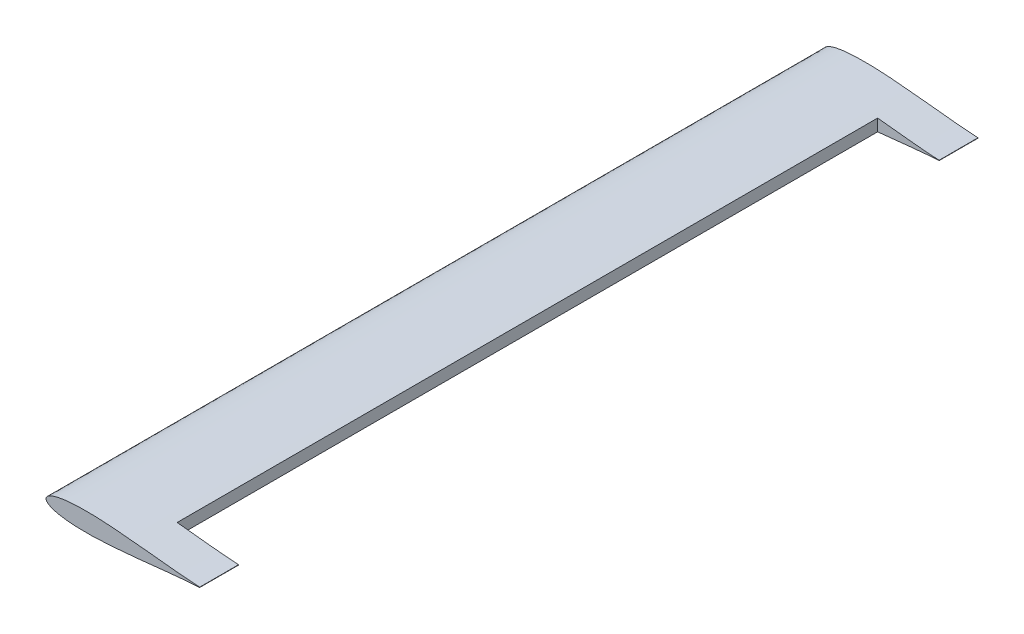
ISO-10303-21;
HEADER;
FILE_DESCRIPTION(('STEP AP214'),'2;1');
FILE_NAME('part.step','',(''),(''),'','','');
FILE_SCHEMA(('AUTOMOTIVE_DESIGN { 1 0 10303 214 1 1 1 1 }'));
ENDSEC;
DATA;
#1=APPLICATION_CONTEXT('core data for automotive mechanical design processes');
#2=APPLICATION_PROTOCOL_DEFINITION('international standard','automotive_design',2000,#1);
#3=PRODUCT_CONTEXT('',#1,'mechanical');
#4=PRODUCT('Part','Part','',(#3));
#5=PRODUCT_RELATED_PRODUCT_CATEGORY('part','',(#4));
#6=PRODUCT_DEFINITION_FORMATION('','',#4);
#7=PRODUCT_DEFINITION_CONTEXT('part definition',#1,'design');
#8=PRODUCT_DEFINITION('design','',#6,#7);
#9=PRODUCT_DEFINITION_SHAPE('','',#8);
#10=(LENGTH_UNIT() NAMED_UNIT(*) SI_UNIT(.MILLI.,.METRE.));
#11=(NAMED_UNIT(*) PLANE_ANGLE_UNIT() SI_UNIT($,.RADIAN.));
#12=(NAMED_UNIT(*) SI_UNIT($,.STERADIAN.) SOLID_ANGLE_UNIT());
#13=UNCERTAINTY_MEASURE_WITH_UNIT(LENGTH_MEASURE(1.E-05),#10,'distance_accuracy_value','');
#14=(GEOMETRIC_REPRESENTATION_CONTEXT(3) GLOBAL_UNCERTAINTY_ASSIGNED_CONTEXT((#13)) GLOBAL_UNIT_ASSIGNED_CONTEXT((#10,
#11,#12)) REPRESENTATION_CONTEXT('',''));
#15=CARTESIAN_POINT('',(0.,0.,0.));
#16=DIRECTION('',(0.,0.,1.));
#17=DIRECTION('',(1.,0.,0.));
#18=AXIS2_PLACEMENT_3D('',#15,#16,#17);
#19=CARTESIAN_POINT('',(120.380960042621,0.131910968299272,609.6));
#20=CARTESIAN_POINT('',(119.946341591372,0.152711181717035,609.6));
#21=CARTESIAN_POINT('',(118.879825677907,0.207805592630858,609.6));
#22=CARTESIAN_POINT('',(117.08577875424,0.313677955019402,609.6));
#23=CARTESIAN_POINT('',(114.917831353132,0.458373702508884,609.6));
#24=CARTESIAN_POINT('',(112.492651454339,0.638201877057179,609.6));
#25=CARTESIAN_POINT('',(109.822798752675,0.853719310043422,609.6));
#26=CARTESIAN_POINT('',(106.921074515127,1.10596019781908,609.6));
#27=CARTESIAN_POINT('',(103.801681224574,1.39396086564061,609.6));
#28=CARTESIAN_POINT('',(100.479715379678,1.715903258336,609.6));
#29=CARTESIAN_POINT('',(96.9715098852466,2.06983989009972,609.6));
#30=CARTESIAN_POINT('',(93.2940190845133,2.45178338883161,609.6));
#31=CARTESIAN_POINT('',(89.4652669803332,2.85749965001338,609.6));
#32=CARTESIAN_POINT('',(85.5038265683255,3.28175383962361,609.6));
#33=CARTESIAN_POINT('',(81.4290640584128,3.71867043285444,609.6));
#34=CARTESIAN_POINT('',(77.2607857308432,4.16196644332822,609.6));
#35=CARTESIAN_POINT('',(73.0192540187374,4.60412633833737,609.6));
#36=CARTESIAN_POINT('',(68.7251814615755,5.03833014971487,609.6));
#37=CARTESIAN_POINT('',(64.3993954621691,5.45636241090781,609.6));
#38=CARTESIAN_POINT('',(60.0630689422249,5.8511871806983,609.6));
#39=CARTESIAN_POINT('',(55.7371976249328,6.21450453810976,609.6));
#40=CARTESIAN_POINT('',(51.4429170425396,6.53920292922603,609.6));
#41=CARTESIAN_POINT('',(47.2010682216459,6.81814245926459,609.6));
#42=CARTESIAN_POINT('',(43.032378562393,7.044765482812,609.6));
#43=CARTESIAN_POINT('',(38.9570756240423,7.2131238750651,609.6));
#44=CARTESIAN_POINT('',(34.9950535304907,7.31806129272744,609.6));
#45=CARTESIAN_POINT('',(31.1655369859121,7.35499411876619,609.6));
#46=CARTESIAN_POINT('',(27.487176118958,7.32085472704815,609.6));
#47=CARTESIAN_POINT('',(23.9778514719472,7.2133186923807,609.6));
#48=CARTESIAN_POINT('',(20.65458384234,7.03092087712962,609.6));
#49=CARTESIAN_POINT('',(17.5335657362209,6.77386612546111,609.6));
#50=CARTESIAN_POINT('',(14.6298165750166,6.44323518671977,609.6));
#51=CARTESIAN_POINT('',(11.9573948264669,6.0415135285638,609.6));
#52=CARTESIAN_POINT('',(9.52907246340726,5.57182535134837,609.6));
#53=CARTESIAN_POINT('',(7.35634522456184,5.03890071156826,609.6));
#54=CARTESIAN_POINT('',(5.449154242808,4.44841293543283,609.6));
#55=CARTESIAN_POINT('',(3.81575648682269,3.80673536377193,609.6));
#56=CARTESIAN_POINT('',(2.46243437823455,3.12068839168507,609.6));
#57=CARTESIAN_POINT('',(1.39284564540725,2.39640323617011,609.6));
#58=CARTESIAN_POINT('',(0.609563184256902,1.6368165884806,609.6));
#59=CARTESIAN_POINT('',(0.117367123716731,0.838378890970886,609.6));
#60=CARTESIAN_POINT('',(-0.0552847629050821,2.99104581426234E-09,609.6));
#61=CARTESIAN_POINT('',(0.117367123704894,-0.83837888472127,609.6));
#62=CARTESIAN_POINT('',(0.609563184025573,-1.63681658324808,609.6));
#63=CARTESIAN_POINT('',(1.39284564602014,-2.39640322626479,609.6));
#64=CARTESIAN_POINT('',(2.46243437450227,-3.12068840478877,609.6));
#65=CARTESIAN_POINT('',(3.81575650366483,-3.80673526716771,609.6));
#66=CARTESIAN_POINT('',(5.44915416369334,-4.44841334986173,609.6));
#67=CARTESIAN_POINT('',(7.35634558030489,-5.03889880962853,609.6));
#68=CARTESIAN_POINT('',(9.52911045651736,-5.57184341063151,609.6));
#69=CARTESIAN_POINT('',(11.9574415479237,-6.04148393778173,609.6));
#70=CARTESIAN_POINT('',(14.6298555388444,-6.44325082392416,609.6));
#71=CARTESIAN_POINT('',(17.5335662716249,-6.77386283887054,609.6));
#72=CARTESIAN_POINT('',(20.6545836842032,-7.03092183851772,609.6));
#73=CARTESIAN_POINT('',(23.9778515175318,-7.21331840609714,609.6));
#74=CARTESIAN_POINT('',(27.4871761053513,-7.32085480345011,609.6));
#75=CARTESIAN_POINT('',(31.1655369893222,-7.35499409112026,609.6));
#76=CARTESIAN_POINT('',(34.9950535290539,-7.3180612949493,609.6));
#77=CARTESIAN_POINT('',(38.9570756239846,-7.21312386915555,609.6));
#78=CARTESIAN_POINT('',(43.0323785619397,-7.044765479253,609.6));
#79=CARTESIAN_POINT('',(47.2010682213922,-6.81814245603485,609.6));
#80=CARTESIAN_POINT('',(51.4429170419562,-6.53920292343117,609.6));
#81=CARTESIAN_POINT('',(55.7371976255696,-6.21450454372676,609.6));
#82=CARTESIAN_POINT('',(60.0630689383638,-5.85118714410005,609.6));
#83=CARTESIAN_POINT('',(64.3993954752394,-5.4563625335447,609.6));
#84=CARTESIAN_POINT('',(68.7251814117802,-5.03832968123,609.6));
#85=CARTESIAN_POINT('',(73.0192542010759,-4.60412805267869,609.6));
#86=CARTESIAN_POINT('',(77.2608260955875,-4.16195588567694,609.6));
#87=CARTESIAN_POINT('',(81.4291075037277,-3.71868880426576,609.6));
#88=CARTESIAN_POINT('',(85.5038669578919,-3.28174358191172,609.6));
#89=CARTESIAN_POINT('',(89.465267139913,-2.85750114213083,609.6));
#90=CARTESIAN_POINT('',(93.2940190448009,-2.45178301982671,609.6));
#91=CARTESIAN_POINT('',(96.9715098922706,-2.06983994571513,609.6));
#92=CARTESIAN_POINT('',(100.479715387468,-1.71590336520414,609.6));
#93=CARTESIAN_POINT('',(103.801681189554,-1.39396042059216,609.6));
#94=CARTESIAN_POINT('',(106.921074635191,-1.10596171727378,609.6));
#95=CARTESIAN_POINT('',(109.822839549634,-0.853710658044162,609.6));
#96=CARTESIAN_POINT('',(112.492693973462,-0.638215275142805,609.6));
#97=CARTESIAN_POINT('',(114.917872344326,-0.4583671580285,609.6));
#98=CARTESIAN_POINT('',(117.085778816815,-0.31367879411563,609.6));
#99=CARTESIAN_POINT('',(118.879825669303,-0.207805471272375,609.6));
#100=CARTESIAN_POINT('',(119.946341588896,-0.152711136566128,609.6));
#101=CARTESIAN_POINT('',(120.380960042621,-0.131910950293715,609.6));
#102=B_SPLINE_CURVE_WITH_KNOTS('',3,(#19,#20,#21,#22,#23,#24,#25,#26,#27,#28,#29,#30,#31,#32,
#33,#34,#35,#36,#37,#38,#39,#40,#41,#42,#43,#44,#45,#46,#47,#48,#49,#50,#51,#52,#53,#54,#55,#56,
#57,#58,#59,#60,#61,#62,#63,#64,#65,#66,#67,#68,#69,#70,#71,#72,#73,#74,#75,#76,#77,#78,#79,#80,
#81,#82,#83,#84,#85,#86,#87,#88,#89,#90,#91,#92,#93,#94,#95,#96,#97,#98,#99,#100,#101),
.UNSPECIFIED.,.F.,.F.,(4,1,1,1,1,1,1,1,1,1,1,1,1,1,1,1,1,1,1,1,1,1,1,1,1,1,1,1,1,1,1,1,1,1,1,1,
1,1,1,1,1,1,1,1,1,1,1,1,1,1,1,1,1,1,1,1,1,1,1,1,1,1,1,1,1,1,1,1,1,1,1,1,1,1,1,1,1,1,1,1,4),
(0.0160663364904521,0.0211984955412252,0.0287083490251523,0.0372782232594889,0.0468676577541645,
0.0574304888249985,0.0689165405493511,0.0812707684186304,0.0944323406956703,0.108338211287356,
0.122918812611824,0.138103257138173,0.15381535008155,0.169977616027225,0.186508903233463,
0.203327312507796,0.220348625887078,0.237487597320464,0.254659894070602,0.271779428103394,
0.288762761842555,0.305526623763621,0.321990034121681,0.338073445698838,0.35370227874714,
0.36880260396014,0.38330614064772,0.397148829263275,0.410269484619131,0.422614247964227,
0.434132859898612,0.444782857413332,0.454526749056834,0.463337037242686,0.471194284854681,
0.478091852397207,0.484041802108811,0.489081613144154,0.493295092146746,0.49684171245836,
0.500000001874181,0.503158291290002,0.506704911601616,0.510918390604208,0.515958201639551,
0.521908151351155,0.528805718893681,0.536662966505675,0.545473254691528,0.5552176272589,
0.565867140304764,0.577385752239149,0.589730515584245,0.602851170940101,0.616693859555656,
0.631197396243236,0.646297721456236,0.661926554504538,0.678009966081695,0.694473376439755,
0.711237238360821,0.728220572099982,0.745340106132774,0.762512402882912,0.779651374316299,
0.79667268769558,0.813491096969914,0.830022871465484,0.8461846501687,0.861896743112077,
0.877081187638426,0.891661788962895,0.90556765955458,0.91872923183162,0.931083459700899,
0.942569511425252,0.953132830940465,0.962721776740511,0.971291650974848,0.978801504458775,
0.983933663514831),.UNSPECIFIED.);
#103=DIRECTION('',(0.,0.,-1.));
#104=VECTOR('',#103,1.);
#105=SURFACE_OF_LINEAR_EXTRUSION('',#102,#104);
#106=CARTESIAN_POINT('',(120.380960042621,0.131910968299272,30.4800000000002));
#107=CARTESIAN_POINT('',(119.946341591372,0.152711181717035,30.4800000000002));
#108=CARTESIAN_POINT('',(118.879825677907,0.207805592630858,30.4800000000002));
#109=CARTESIAN_POINT('',(117.08577875424,0.313677955019402,30.4800000000002));
#110=CARTESIAN_POINT('',(114.917831353132,0.458373702508884,30.4800000000002));
#111=CARTESIAN_POINT('',(112.492651454339,0.638201877057179,30.4800000000002));
#112=CARTESIAN_POINT('',(109.822798752675,0.853719310043422,30.4800000000002));
#113=CARTESIAN_POINT('',(106.921074515127,1.10596019781908,30.4800000000002));
#114=CARTESIAN_POINT('',(103.801681224574,1.39396086564061,30.4800000000002));
#115=CARTESIAN_POINT('',(100.479715379678,1.715903258336,30.4800000000002));
#116=CARTESIAN_POINT('',(96.9715098852466,2.06983989009972,30.4800000000002));
#117=CARTESIAN_POINT('',(93.2940190845133,2.45178338883161,30.4800000000002));
#118=CARTESIAN_POINT('',(89.4652669803332,2.85749965001338,30.4800000000002));
#119=CARTESIAN_POINT('',(85.5038265683255,3.28175383962361,30.4800000000002));
#120=CARTESIAN_POINT('',(81.4290640584128,3.71867043285444,30.4800000000002));
#121=CARTESIAN_POINT('',(77.2607857308432,4.16196644332822,30.4800000000002));
#122=CARTESIAN_POINT('',(73.0192540187374,4.60412633833737,30.4800000000002));
#123=CARTESIAN_POINT('',(68.7251814615755,5.03833014971487,30.4800000000002));
#124=CARTESIAN_POINT('',(64.3993954621691,5.45636241090781,30.4800000000002));
#125=CARTESIAN_POINT('',(60.0630689422249,5.8511871806983,30.4800000000002));
#126=CARTESIAN_POINT('',(55.7371976249328,6.21450453810976,30.4800000000002));
#127=CARTESIAN_POINT('',(51.4429170425396,6.53920292922603,30.4800000000002));
#128=CARTESIAN_POINT('',(47.2010682216459,6.81814245926459,30.4800000000002));
#129=CARTESIAN_POINT('',(43.032378562393,7.044765482812,30.4800000000002));
#130=CARTESIAN_POINT('',(38.9570756240423,7.2131238750651,30.4800000000002));
#131=CARTESIAN_POINT('',(34.9950535304907,7.31806129272744,30.4800000000002));
#132=CARTESIAN_POINT('',(31.1655369859121,7.35499411876619,30.4800000000002));
#133=CARTESIAN_POINT('',(27.487176118958,7.32085472704815,30.4800000000002));
#134=CARTESIAN_POINT('',(23.9778514719472,7.2133186923807,30.4800000000002));
#135=CARTESIAN_POINT('',(20.65458384234,7.03092087712962,30.4800000000002));
#136=CARTESIAN_POINT('',(17.5335657362209,6.77386612546111,30.4800000000002));
#137=CARTESIAN_POINT('',(14.6298165750166,6.44323518671977,30.4800000000002));
#138=CARTESIAN_POINT('',(11.9573948264669,6.0415135285638,30.4800000000002));
#139=CARTESIAN_POINT('',(9.52907246340726,5.57182535134837,30.4800000000002));
#140=CARTESIAN_POINT('',(7.35634522456184,5.03890071156826,30.4800000000002));
#141=CARTESIAN_POINT('',(5.449154242808,4.44841293543283,30.4800000000002));
#142=CARTESIAN_POINT('',(3.81575648682269,3.80673536377193,30.4800000000002));
#143=CARTESIAN_POINT('',(2.46243437823455,3.12068839168507,30.4800000000002));
#144=CARTESIAN_POINT('',(1.39284564540725,2.39640323617011,30.4800000000002));
#145=CARTESIAN_POINT('',(0.609563184256902,1.6368165884806,30.4800000000002));
#146=CARTESIAN_POINT('',(0.117367123716731,0.838378890970886,30.4800000000002));
#147=CARTESIAN_POINT('',(-0.0552847629050821,2.99104581426234E-09,30.4800000000002));
#148=CARTESIAN_POINT('',(0.117367123704894,-0.83837888472127,30.4800000000002));
#149=CARTESIAN_POINT('',(0.609563184025573,-1.63681658324808,30.4800000000002));
#150=CARTESIAN_POINT('',(1.39284564602014,-2.39640322626479,30.4800000000002));
#151=CARTESIAN_POINT('',(2.46243437450227,-3.12068840478877,30.4800000000002));
#152=CARTESIAN_POINT('',(3.81575650366483,-3.80673526716771,30.4800000000002));
#153=CARTESIAN_POINT('',(5.44915416369334,-4.44841334986173,30.4800000000002));
#154=CARTESIAN_POINT('',(7.35634558030489,-5.03889880962853,30.4800000000002));
#155=CARTESIAN_POINT('',(9.52911045651736,-5.57184341063151,30.4800000000002));
#156=CARTESIAN_POINT('',(11.9574415479237,-6.04148393778173,30.4800000000002));
#157=CARTESIAN_POINT('',(14.6298555388444,-6.44325082392416,30.4800000000002));
#158=CARTESIAN_POINT('',(17.5335662716249,-6.77386283887054,30.4800000000002));
#159=CARTESIAN_POINT('',(20.6545836842032,-7.03092183851772,30.4800000000002));
#160=CARTESIAN_POINT('',(23.9778515175318,-7.21331840609714,30.4800000000002));
#161=CARTESIAN_POINT('',(27.4871761053513,-7.32085480345011,30.4800000000002));
#162=CARTESIAN_POINT('',(31.1655369893222,-7.35499409112026,30.4800000000002));
#163=CARTESIAN_POINT('',(34.9950535290539,-7.3180612949493,30.4800000000002));
#164=CARTESIAN_POINT('',(38.9570756239846,-7.21312386915555,30.4800000000002));
#165=CARTESIAN_POINT('',(43.0323785619397,-7.044765479253,30.4800000000002));
#166=CARTESIAN_POINT('',(47.2010682213922,-6.81814245603485,30.4800000000002));
#167=CARTESIAN_POINT('',(51.4429170419562,-6.53920292343117,30.4800000000002));
#168=CARTESIAN_POINT('',(55.7371976255696,-6.21450454372676,30.4800000000002));
#169=CARTESIAN_POINT('',(60.0630689383638,-5.85118714410005,30.4800000000002));
#170=CARTESIAN_POINT('',(64.3993954752394,-5.4563625335447,30.4800000000002));
#171=CARTESIAN_POINT('',(68.7251814117802,-5.03832968123,30.4800000000002));
#172=CARTESIAN_POINT('',(73.0192542010759,-4.60412805267869,30.4800000000002));
#173=CARTESIAN_POINT('',(77.2608260955875,-4.16195588567694,30.4800000000002));
#174=CARTESIAN_POINT('',(81.4291075037277,-3.71868880426576,30.4800000000002));
#175=CARTESIAN_POINT('',(85.5038669578919,-3.28174358191172,30.4800000000002));
#176=CARTESIAN_POINT('',(89.465267139913,-2.85750114213083,30.4800000000002));
#177=CARTESIAN_POINT('',(93.2940190448009,-2.45178301982671,30.4800000000002));
#178=CARTESIAN_POINT('',(96.9715098922706,-2.06983994571513,30.4800000000002));
#179=CARTESIAN_POINT('',(100.479715387468,-1.71590336520414,30.4800000000002));
#180=CARTESIAN_POINT('',(103.801681189554,-1.39396042059216,30.4800000000002));
#181=CARTESIAN_POINT('',(106.921074635191,-1.10596171727378,30.4800000000002));
#182=CARTESIAN_POINT('',(109.822839549634,-0.853710658044162,30.4800000000002));
#183=CARTESIAN_POINT('',(112.492693973462,-0.638215275142805,30.4800000000002));
#184=CARTESIAN_POINT('',(114.917872344326,-0.4583671580285,30.4800000000002));
#185=CARTESIAN_POINT('',(117.085778816815,-0.31367879411563,30.4800000000002));
#186=CARTESIAN_POINT('',(118.879825669303,-0.207805471272375,30.4800000000002));
#187=CARTESIAN_POINT('',(119.946341588896,-0.152711136566128,30.4800000000002));
#188=CARTESIAN_POINT('',(120.380960042621,-0.131910950293715,30.4800000000002));
#189=B_SPLINE_CURVE_WITH_KNOTS('',3,(#106,#107,#108,#109,#110,#111,#112,#113,#114,#115,#116,
#117,#118,#119,#120,#121,#122,#123,#124,#125,#126,#127,#128,#129,#130,#131,#132,#133,#134,#135,
#136,#137,#138,#139,#140,#141,#142,#143,#144,#145,#146,#147,#148,#149,#150,#151,#152,#153,#154,
#155,#156,#157,#158,#159,#160,#161,#162,#163,#164,#165,#166,#167,#168,#169,#170,#171,#172,#173,
#174,#175,#176,#177,#178,#179,#180,#181,#182,#183,#184,#185,#186,#187,#188),.UNSPECIFIED.,.F.,
.F.,(4,1,1,1,1,1,1,1,1,1,1,1,1,1,1,1,1,1,1,1,1,1,1,1,1,1,1,1,1,1,1,1,1,1,1,1,1,1,1,1,1,1,1,1,1,
1,1,1,1,1,1,1,1,1,1,1,1,1,1,1,1,1,1,1,1,1,1,1,1,1,1,1,1,1,1,1,1,1,1,1,4),(0.0160663364904521,
0.0211984955412252,0.0287083490251523,0.0372782232594889,0.0468676577541645,0.0574304888249985,
0.0689165405493511,0.0812707684186304,0.0944323406956703,0.108338211287356,0.122918812611824,
0.138103257138173,0.15381535008155,0.169977616027225,0.186508903233463,0.203327312507796,
0.220348625887078,0.237487597320464,0.254659894070602,0.271779428103394,0.288762761842555,
0.305526623763621,0.321990034121681,0.338073445698838,0.35370227874714,0.36880260396014,
0.38330614064772,0.397148829263275,0.410269484619131,0.422614247964227,0.434132859898612,
0.444782857413332,0.454526749056834,0.463337037242686,0.471194284854681,0.478091852397207,
0.484041802108811,0.489081613144154,0.493295092146746,0.49684171245836,0.500000001874181,
0.503158291290002,0.506704911601616,0.510918390604208,0.515958201639551,0.521908151351155,
0.528805718893681,0.536662966505675,0.545473254691528,0.5552176272589,0.565867140304764,
0.577385752239149,0.589730515584245,0.602851170940101,0.616693859555656,0.631197396243236,
0.646297721456236,0.661926554504538,0.678009966081695,0.694473376439755,0.711237238360821,
0.728220572099982,0.745340106132774,0.762512402882912,0.779651374316299,0.79667268769558,
0.813491096969914,0.830022871465484,0.8461846501687,0.861896743112077,0.877081187638426,
0.891661788962895,0.90556765955458,0.91872923183162,0.931083459700899,0.942569511425252,
0.953132830940465,0.962721776740511,0.971291650974848,0.978801504458775,0.983933663514831),.UNSPECIFIED.);
#190=CARTESIAN_POINT('',(72.2327200426212,-4.68242501466375,30.48));
#191=VERTEX_POINT('',#190);
#192=CARTESIAN_POINT('',(120.380960042621,-0.131910950293718,30.48));
#193=VERTEX_POINT('',#192);
#194=EDGE_CURVE('E100',#191,#193,#189,.T.);
#195=ORIENTED_EDGE('',*,*,#194,.F.);
#196=DIRECTION('',(0.,0.,-1.));
#197=VECTOR('',#196,1.);
#198=CARTESIAN_POINT('',(72.2327200426213,-4.68242501466375,609.6));
#199=LINE('',#198,#197);
#200=CARTESIAN_POINT('',(72.2327200426213,-4.68242501466374,579.12));
#201=VERTEX_POINT('',#200);
#202=EDGE_CURVE('E11',#201,#191,#199,.T.);
#203=ORIENTED_EDGE('',*,*,#202,.F.);
#204=CARTESIAN_POINT('',(120.380960042621,0.131910968299272,579.12));
#205=CARTESIAN_POINT('',(119.946341591372,0.152711181717035,579.12));
#206=CARTESIAN_POINT('',(118.879825677907,0.207805592630858,579.12));
#207=CARTESIAN_POINT('',(117.08577875424,0.313677955019402,579.12));
#208=CARTESIAN_POINT('',(114.917831353132,0.458373702508884,579.12));
#209=CARTESIAN_POINT('',(112.492651454339,0.638201877057179,579.12));
#210=CARTESIAN_POINT('',(109.822798752675,0.853719310043422,579.12));
#211=CARTESIAN_POINT('',(106.921074515127,1.10596019781908,579.12));
#212=CARTESIAN_POINT('',(103.801681224574,1.39396086564061,579.12));
#213=CARTESIAN_POINT('',(100.479715379678,1.715903258336,579.12));
#214=CARTESIAN_POINT('',(96.9715098852466,2.06983989009972,579.12));
#215=CARTESIAN_POINT('',(93.2940190845133,2.45178338883161,579.12));
#216=CARTESIAN_POINT('',(89.4652669803332,2.85749965001338,579.12));
#217=CARTESIAN_POINT('',(85.5038265683255,3.28175383962361,579.12));
#218=CARTESIAN_POINT('',(81.4290640584128,3.71867043285444,579.12));
#219=CARTESIAN_POINT('',(77.2607857308432,4.16196644332822,579.12));
#220=CARTESIAN_POINT('',(73.0192540187374,4.60412633833737,579.12));
#221=CARTESIAN_POINT('',(68.7251814615755,5.03833014971487,579.12));
#222=CARTESIAN_POINT('',(64.3993954621691,5.45636241090781,579.12));
#223=CARTESIAN_POINT('',(60.0630689422249,5.8511871806983,579.12));
#224=CARTESIAN_POINT('',(55.7371976249328,6.21450453810976,579.12));
#225=CARTESIAN_POINT('',(51.4429170425396,6.53920292922603,579.12));
#226=CARTESIAN_POINT('',(47.2010682216459,6.81814245926459,579.12));
#227=CARTESIAN_POINT('',(43.032378562393,7.044765482812,579.12));
#228=CARTESIAN_POINT('',(38.9570756240423,7.2131238750651,579.12));
#229=CARTESIAN_POINT('',(34.9950535304907,7.31806129272744,579.12));
#230=CARTESIAN_POINT('',(31.1655369859121,7.35499411876619,579.12));
#231=CARTESIAN_POINT('',(27.487176118958,7.32085472704815,579.12));
#232=CARTESIAN_POINT('',(23.9778514719472,7.2133186923807,579.12));
#233=CARTESIAN_POINT('',(20.65458384234,7.03092087712962,579.12));
#234=CARTESIAN_POINT('',(17.5335657362209,6.77386612546111,579.12));
#235=CARTESIAN_POINT('',(14.6298165750166,6.44323518671977,579.12));
#236=CARTESIAN_POINT('',(11.9573948264669,6.0415135285638,579.12));
#237=CARTESIAN_POINT('',(9.52907246340726,5.57182535134837,579.12));
#238=CARTESIAN_POINT('',(7.35634522456184,5.03890071156826,579.12));
#239=CARTESIAN_POINT('',(5.449154242808,4.44841293543283,579.12));
#240=CARTESIAN_POINT('',(3.81575648682269,3.80673536377193,579.12));
#241=CARTESIAN_POINT('',(2.46243437823455,3.12068839168507,579.12));
#242=CARTESIAN_POINT('',(1.39284564540725,2.39640323617011,579.12));
#243=CARTESIAN_POINT('',(0.609563184256902,1.6368165884806,579.12));
#244=CARTESIAN_POINT('',(0.117367123716731,0.838378890970886,579.12));
#245=CARTESIAN_POINT('',(-0.0552847629050821,2.99104581426234E-09,579.12));
#246=CARTESIAN_POINT('',(0.117367123704894,-0.83837888472127,579.12));
#247=CARTESIAN_POINT('',(0.609563184025573,-1.63681658324808,579.12));
#248=CARTESIAN_POINT('',(1.39284564602014,-2.39640322626479,579.12));
#249=CARTESIAN_POINT('',(2.46243437450227,-3.12068840478877,579.12));
#250=CARTESIAN_POINT('',(3.81575650366483,-3.80673526716771,579.12));
#251=CARTESIAN_POINT('',(5.44915416369334,-4.44841334986173,579.12));
#252=CARTESIAN_POINT('',(7.35634558030489,-5.03889880962853,579.12));
#253=CARTESIAN_POINT('',(9.52911045651736,-5.57184341063151,579.12));
#254=CARTESIAN_POINT('',(11.9574415479237,-6.04148393778173,579.12));
#255=CARTESIAN_POINT('',(14.6298555388444,-6.44325082392416,579.12));
#256=CARTESIAN_POINT('',(17.5335662716249,-6.77386283887054,579.12));
#257=CARTESIAN_POINT('',(20.6545836842032,-7.03092183851772,579.12));
#258=CARTESIAN_POINT('',(23.9778515175318,-7.21331840609714,579.12));
#259=CARTESIAN_POINT('',(27.4871761053513,-7.32085480345011,579.12));
#260=CARTESIAN_POINT('',(31.1655369893222,-7.35499409112026,579.12));
#261=CARTESIAN_POINT('',(34.9950535290539,-7.3180612949493,579.12));
#262=CARTESIAN_POINT('',(38.9570756239846,-7.21312386915555,579.12));
#263=CARTESIAN_POINT('',(43.0323785619397,-7.044765479253,579.12));
#264=CARTESIAN_POINT('',(47.2010682213922,-6.81814245603485,579.12));
#265=CARTESIAN_POINT('',(51.4429170419562,-6.53920292343117,579.12));
#266=CARTESIAN_POINT('',(55.7371976255696,-6.21450454372676,579.12));
#267=CARTESIAN_POINT('',(60.0630689383638,-5.85118714410005,579.12));
#268=CARTESIAN_POINT('',(64.3993954752394,-5.4563625335447,579.12));
#269=CARTESIAN_POINT('',(68.7251814117802,-5.03832968123,579.12));
#270=CARTESIAN_POINT('',(73.0192542010759,-4.60412805267869,579.12));
#271=CARTESIAN_POINT('',(77.2608260955875,-4.16195588567694,579.12));
#272=CARTESIAN_POINT('',(81.4291075037277,-3.71868880426576,579.12));
#273=CARTESIAN_POINT('',(85.5038669578919,-3.28174358191172,579.12));
#274=CARTESIAN_POINT('',(89.465267139913,-2.85750114213083,579.12));
#275=CARTESIAN_POINT('',(93.2940190448009,-2.45178301982671,579.12));
#276=CARTESIAN_POINT('',(96.9715098922706,-2.06983994571513,579.12));
#277=CARTESIAN_POINT('',(100.479715387468,-1.71590336520414,579.12));
#278=CARTESIAN_POINT('',(103.801681189554,-1.39396042059216,579.12));
#279=CARTESIAN_POINT('',(106.921074635191,-1.10596171727378,579.12));
#280=CARTESIAN_POINT('',(109.822839549634,-0.853710658044162,579.12));
#281=CARTESIAN_POINT('',(112.492693973462,-0.638215275142805,579.12));
#282=CARTESIAN_POINT('',(114.917872344326,-0.4583671580285,579.12));
#283=CARTESIAN_POINT('',(117.085778816815,-0.31367879411563,579.12));
#284=CARTESIAN_POINT('',(118.879825669303,-0.207805471272375,579.12));
#285=CARTESIAN_POINT('',(119.946341588896,-0.152711136566128,579.12));
#286=CARTESIAN_POINT('',(120.380960042621,-0.131910950293715,579.12));
#287=B_SPLINE_CURVE_WITH_KNOTS('',3,(#204,#205,#206,#207,#208,#209,#210,#211,#212,#213,#214,
#215,#216,#217,#218,#219,#220,#221,#222,#223,#224,#225,#226,#227,#228,#229,#230,#231,#232,#233,
#234,#235,#236,#237,#238,#239,#240,#241,#242,#243,#244,#245,#246,#247,#248,#249,#250,#251,#252,
#253,#254,#255,#256,#257,#258,#259,#260,#261,#262,#263,#264,#265,#266,#267,#268,#269,#270,#271,
#272,#273,#274,#275,#276,#277,#278,#279,#280,#281,#282,#283,#284,#285,#286),.UNSPECIFIED.,.F.,
.F.,(4,1,1,1,1,1,1,1,1,1,1,1,1,1,1,1,1,1,1,1,1,1,1,1,1,1,1,1,1,1,1,1,1,1,1,1,1,1,1,1,1,1,1,1,1,
1,1,1,1,1,1,1,1,1,1,1,1,1,1,1,1,1,1,1,1,1,1,1,1,1,1,1,1,1,1,1,1,1,1,1,4),(0.0160663364904521,
0.0211984955412252,0.0287083490251523,0.0372782232594889,0.0468676577541645,0.0574304888249985,
0.0689165405493511,0.0812707684186304,0.0944323406956703,0.108338211287356,0.122918812611824,
0.138103257138173,0.15381535008155,0.169977616027225,0.186508903233463,0.203327312507796,
0.220348625887078,0.237487597320464,0.254659894070602,0.271779428103394,0.288762761842555,
0.305526623763621,0.321990034121681,0.338073445698838,0.35370227874714,0.36880260396014,
0.38330614064772,0.397148829263275,0.410269484619131,0.422614247964227,0.434132859898612,
0.444782857413332,0.454526749056834,0.463337037242686,0.471194284854681,0.478091852397207,
0.484041802108811,0.489081613144154,0.493295092146746,0.49684171245836,0.500000001874181,
0.503158291290002,0.506704911601616,0.510918390604208,0.515958201639551,0.521908151351155,
0.528805718893681,0.536662966505675,0.545473254691528,0.5552176272589,0.565867140304764,
0.577385752239149,0.589730515584245,0.602851170940101,0.616693859555656,0.631197396243236,
0.646297721456236,0.661926554504538,0.678009966081695,0.694473376439755,0.711237238360821,
0.728220572099982,0.745340106132774,0.762512402882912,0.779651374316299,0.79667268769558,
0.813491096969914,0.830022871465484,0.8461846501687,0.861896743112077,0.877081187638426,
0.891661788962895,0.90556765955458,0.91872923183162,0.931083459700899,0.942569511425252,
0.953132830940465,0.962721776740511,0.971291650974848,0.978801504458775,0.983933663514831),.UNSPECIFIED.);
#288=CARTESIAN_POINT('',(120.380960042621,-0.131910950293718,579.12));
#289=VERTEX_POINT('',#288);
#290=EDGE_CURVE('E134',#289,#201,#287,.F.);
#291=ORIENTED_EDGE('',*,*,#290,.F.);
#292=DIRECTION('',(0.,0.,-1.));
#293=VECTOR('',#292,1.);
#294=CARTESIAN_POINT('',(120.380960042621,-0.131910950293718,609.6));
#295=LINE('',#294,#293);
#296=CARTESIAN_POINT('',(120.380960042621,-0.131910950293718,609.6));
#297=VERTEX_POINT('',#296);
#298=EDGE_CURVE('E110',#297,#289,#295,.T.);
#299=ORIENTED_EDGE('',*,*,#298,.F.);
#300=CARTESIAN_POINT('',(120.380960042621,0.131910968299269,609.6));
#301=VERTEX_POINT('',#300);
#302=EDGE_CURVE('E96',#301,#297,#102,.T.);
#303=ORIENTED_EDGE('',*,*,#302,.F.);
#304=DIRECTION('',(0.,0.,-1.));
#305=VECTOR('',#304,1.);
#306=CARTESIAN_POINT('',(120.380960042621,0.131910968299269,609.6));
#307=LINE('',#306,#305);
#308=CARTESIAN_POINT('',(120.380960042621,0.131910968299269,579.12));
#309=VERTEX_POINT('',#308);
#310=EDGE_CURVE('E89',#301,#309,#307,.T.);
#311=ORIENTED_EDGE('',*,*,#310,.T.);
#312=CARTESIAN_POINT('',(72.2327200426213,4.68242462070161,579.12));
#313=VERTEX_POINT('',#312);
#314=EDGE_CURVE('E56',#313,#309,#287,.F.);
#315=ORIENTED_EDGE('',*,*,#314,.F.);
#316=DIRECTION('',(0.,0.,-1.));
#317=VECTOR('',#316,1.);
#318=CARTESIAN_POINT('',(72.2327200426213,4.68242462070163,609.6));
#319=LINE('',#318,#317);
#320=CARTESIAN_POINT('',(72.2327200426212,4.68242462070162,30.48));
#321=VERTEX_POINT('',#320);
#322=EDGE_CURVE('E49',#321,#313,#319,.F.);
#323=ORIENTED_EDGE('',*,*,#322,.F.);
#324=CARTESIAN_POINT('',(120.380960042621,0.131910968299269,30.48));
#325=VERTEX_POINT('',#324);
#326=EDGE_CURVE('E86',#325,#321,#189,.T.);
#327=ORIENTED_EDGE('',*,*,#326,.F.);
#328=CARTESIAN_POINT('',(120.380960042621,0.131910968299269,0.));
#329=VERTEX_POINT('',#328);
#330=EDGE_CURVE('E78',#325,#329,#307,.T.);
#331=ORIENTED_EDGE('',*,*,#330,.T.);
#332=CARTESIAN_POINT('',(120.380960042621,0.131910968299272,0.));
#333=CARTESIAN_POINT('',(119.946341591372,0.152711181717035,0.));
#334=CARTESIAN_POINT('',(118.879825677907,0.207805592630858,0.));
#335=CARTESIAN_POINT('',(117.08577875424,0.313677955019402,0.));
#336=CARTESIAN_POINT('',(114.917831353132,0.458373702508884,0.));
#337=CARTESIAN_POINT('',(112.492651454339,0.638201877057179,0.));
#338=CARTESIAN_POINT('',(109.822798752675,0.853719310043422,0.));
#339=CARTESIAN_POINT('',(106.921074515127,1.10596019781908,0.));
#340=CARTESIAN_POINT('',(103.801681224574,1.39396086564061,0.));
#341=CARTESIAN_POINT('',(100.479715379678,1.715903258336,0.));
#342=CARTESIAN_POINT('',(96.9715098852466,2.06983989009972,0.));
#343=CARTESIAN_POINT('',(93.2940190845133,2.45178338883161,0.));
#344=CARTESIAN_POINT('',(89.4652669803332,2.85749965001338,0.));
#345=CARTESIAN_POINT('',(85.5038265683255,3.28175383962361,0.));
#346=CARTESIAN_POINT('',(81.4290640584128,3.71867043285444,0.));
#347=CARTESIAN_POINT('',(77.2607857308432,4.16196644332822,0.));
#348=CARTESIAN_POINT('',(73.0192540187374,4.60412633833737,0.));
#349=CARTESIAN_POINT('',(68.7251814615755,5.03833014971487,0.));
#350=CARTESIAN_POINT('',(64.3993954621691,5.45636241090781,0.));
#351=CARTESIAN_POINT('',(60.0630689422249,5.8511871806983,0.));
#352=CARTESIAN_POINT('',(55.7371976249328,6.21450453810976,0.));
#353=CARTESIAN_POINT('',(51.4429170425396,6.53920292922603,0.));
#354=CARTESIAN_POINT('',(47.2010682216459,6.81814245926459,0.));
#355=CARTESIAN_POINT('',(43.032378562393,7.044765482812,0.));
#356=CARTESIAN_POINT('',(38.9570756240423,7.2131238750651,0.));
#357=CARTESIAN_POINT('',(34.9950535304907,7.31806129272744,0.));
#358=CARTESIAN_POINT('',(31.1655369859121,7.35499411876619,0.));
#359=CARTESIAN_POINT('',(27.487176118958,7.32085472704815,0.));
#360=CARTESIAN_POINT('',(23.9778514719472,7.2133186923807,0.));
#361=CARTESIAN_POINT('',(20.65458384234,7.03092087712962,0.));
#362=CARTESIAN_POINT('',(17.5335657362209,6.77386612546111,0.));
#363=CARTESIAN_POINT('',(14.6298165750166,6.44323518671977,0.));
#364=CARTESIAN_POINT('',(11.9573948264669,6.0415135285638,0.));
#365=CARTESIAN_POINT('',(9.52907246340726,5.57182535134837,0.));
#366=CARTESIAN_POINT('',(7.35634522456184,5.03890071156826,0.));
#367=CARTESIAN_POINT('',(5.449154242808,4.44841293543283,0.));
#368=CARTESIAN_POINT('',(3.81575648682269,3.80673536377193,0.));
#369=CARTESIAN_POINT('',(2.46243437823455,3.12068839168507,0.));
#370=CARTESIAN_POINT('',(1.39284564540725,2.39640323617011,0.));
#371=CARTESIAN_POINT('',(0.609563184256902,1.6368165884806,0.));
#372=CARTESIAN_POINT('',(0.117367123716731,0.838378890970886,0.));
#373=CARTESIAN_POINT('',(-0.0552847629050821,2.99104581426234E-09,0.));
#374=CARTESIAN_POINT('',(0.117367123704894,-0.83837888472127,0.));
#375=CARTESIAN_POINT('',(0.609563184025573,-1.63681658324808,0.));
#376=CARTESIAN_POINT('',(1.39284564602014,-2.39640322626479,0.));
#377=CARTESIAN_POINT('',(2.46243437450227,-3.12068840478877,0.));
#378=CARTESIAN_POINT('',(3.81575650366483,-3.80673526716771,0.));
#379=CARTESIAN_POINT('',(5.44915416369334,-4.44841334986173,0.));
#380=CARTESIAN_POINT('',(7.35634558030489,-5.03889880962853,0.));
#381=CARTESIAN_POINT('',(9.52911045651736,-5.57184341063151,0.));
#382=CARTESIAN_POINT('',(11.9574415479237,-6.04148393778173,0.));
#383=CARTESIAN_POINT('',(14.6298555388444,-6.44325082392416,0.));
#384=CARTESIAN_POINT('',(17.5335662716249,-6.77386283887054,0.));
#385=CARTESIAN_POINT('',(20.6545836842032,-7.03092183851772,0.));
#386=CARTESIAN_POINT('',(23.9778515175318,-7.21331840609714,0.));
#387=CARTESIAN_POINT('',(27.4871761053513,-7.32085480345011,0.));
#388=CARTESIAN_POINT('',(31.1655369893222,-7.35499409112026,0.));
#389=CARTESIAN_POINT('',(34.9950535290539,-7.3180612949493,0.));
#390=CARTESIAN_POINT('',(38.9570756239846,-7.21312386915555,0.));
#391=CARTESIAN_POINT('',(43.0323785619397,-7.044765479253,0.));
#392=CARTESIAN_POINT('',(47.2010682213922,-6.81814245603485,0.));
#393=CARTESIAN_POINT('',(51.4429170419562,-6.53920292343117,0.));
#394=CARTESIAN_POINT('',(55.7371976255696,-6.21450454372676,0.));
#395=CARTESIAN_POINT('',(60.0630689383638,-5.85118714410005,0.));
#396=CARTESIAN_POINT('',(64.3993954752394,-5.4563625335447,0.));
#397=CARTESIAN_POINT('',(68.7251814117802,-5.03832968123,0.));
#398=CARTESIAN_POINT('',(73.0192542010759,-4.60412805267869,0.));
#399=CARTESIAN_POINT('',(77.2608260955875,-4.16195588567694,0.));
#400=CARTESIAN_POINT('',(81.4291075037277,-3.71868880426576,0.));
#401=CARTESIAN_POINT('',(85.5038669578919,-3.28174358191172,0.));
#402=CARTESIAN_POINT('',(89.465267139913,-2.85750114213083,0.));
#403=CARTESIAN_POINT('',(93.2940190448009,-2.45178301982671,0.));
#404=CARTESIAN_POINT('',(96.9715098922706,-2.06983994571513,0.));
#405=CARTESIAN_POINT('',(100.479715387468,-1.71590336520414,0.));
#406=CARTESIAN_POINT('',(103.801681189554,-1.39396042059216,0.));
#407=CARTESIAN_POINT('',(106.921074635191,-1.10596171727378,0.));
#408=CARTESIAN_POINT('',(109.822839549634,-0.853710658044162,0.));
#409=CARTESIAN_POINT('',(112.492693973462,-0.638215275142805,0.));
#410=CARTESIAN_POINT('',(114.917872344326,-0.4583671580285,0.));
#411=CARTESIAN_POINT('',(117.085778816815,-0.31367879411563,0.));
#412=CARTESIAN_POINT('',(118.879825669303,-0.207805471272375,0.));
#413=CARTESIAN_POINT('',(119.946341588896,-0.152711136566128,0.));
#414=CARTESIAN_POINT('',(120.380960042621,-0.131910950293715,0.));
#415=B_SPLINE_CURVE_WITH_KNOTS('',3,(#332,#333,#334,#335,#336,#337,#338,#339,#340,#341,#342,
#343,#344,#345,#346,#347,#348,#349,#350,#351,#352,#353,#354,#355,#356,#357,#358,#359,#360,#361,
#362,#363,#364,#365,#366,#367,#368,#369,#370,#371,#372,#373,#374,#375,#376,#377,#378,#379,#380,
#381,#382,#383,#384,#385,#386,#387,#388,#389,#390,#391,#392,#393,#394,#395,#396,#397,#398,#399,
#400,#401,#402,#403,#404,#405,#406,#407,#408,#409,#410,#411,#412,#413,#414),.UNSPECIFIED.,.F.,
.F.,(4,1,1,1,1,1,1,1,1,1,1,1,1,1,1,1,1,1,1,1,1,1,1,1,1,1,1,1,1,1,1,1,1,1,1,1,1,1,1,1,1,1,1,1,1,
1,1,1,1,1,1,1,1,1,1,1,1,1,1,1,1,1,1,1,1,1,1,1,1,1,1,1,1,1,1,1,1,1,1,1,4),(0.0160663364904521,
0.0211984955412252,0.0287083490251523,0.0372782232594889,0.0468676577541645,0.0574304888249985,
0.0689165405493511,0.0812707684186304,0.0944323406956703,0.108338211287356,0.122918812611824,
0.138103257138173,0.15381535008155,0.169977616027225,0.186508903233463,0.203327312507796,
0.220348625887078,0.237487597320464,0.254659894070602,0.271779428103394,0.288762761842555,
0.305526623763621,0.321990034121681,0.338073445698838,0.35370227874714,0.36880260396014,
0.38330614064772,0.397148829263275,0.410269484619131,0.422614247964227,0.434132859898612,
0.444782857413332,0.454526749056834,0.463337037242686,0.471194284854681,0.478091852397207,
0.484041802108811,0.489081613144154,0.493295092146746,0.49684171245836,0.500000001874181,
0.503158291290002,0.506704911601616,0.510918390604208,0.515958201639551,0.521908151351155,
0.528805718893681,0.536662966505675,0.545473254691528,0.5552176272589,0.565867140304764,
0.577385752239149,0.589730515584245,0.602851170940101,0.616693859555656,0.631197396243236,
0.646297721456236,0.661926554504538,0.678009966081695,0.694473376439755,0.711237238360821,
0.728220572099982,0.745340106132774,0.762512402882912,0.779651374316299,0.79667268769558,
0.813491096969914,0.830022871465484,0.8461846501687,0.861896743112077,0.877081187638426,
0.891661788962895,0.90556765955458,0.91872923183162,0.931083459700899,0.942569511425252,
0.953132830940465,0.962721776740511,0.971291650974848,0.978801504458775,0.983933663514831),.UNSPECIFIED.);
#416=CARTESIAN_POINT('',(120.380960042621,-0.131910950293718,0.));
#417=VERTEX_POINT('',#416);
#418=EDGE_CURVE('E83',#329,#417,#415,.T.);
#419=ORIENTED_EDGE('',*,*,#418,.T.);
#420=EDGE_CURVE('E94',#193,#417,#295,.T.);
#421=ORIENTED_EDGE('',*,*,#420,.F.);
#422=EDGE_LOOP('',(#195,#203,#291,#299,#303,#311,#315,#323,#327,#331,#419,#421));
#423=FACE_BOUND('',#422,.T.);
#424=ADVANCED_FACE('F41',(#423),#105,.F.);
#425=CARTESIAN_POINT('',(120.380960042621,0.131910968299269,609.6));
#426=DIRECTION('',(-1.,0.,0.));
#427=DIRECTION('',(0.,0.,1.));
#428=AXIS2_PLACEMENT_3D('',#425,#426,#427);
#429=PLANE('',#428);
#430=DIRECTION('',(0.,1.,0.));
#431=VECTOR('',#430,1.);
#432=CARTESIAN_POINT('',(120.380960042621,0.131910968299269,30.48));
#433=LINE('',#432,#431);
#434=EDGE_CURVE('E115',#193,#325,#433,.T.);
#435=ORIENTED_EDGE('',*,*,#434,.F.);
#436=ORIENTED_EDGE('',*,*,#420,.T.);
#437=DIRECTION('',(0.,1.,0.));
#438=VECTOR('',#437,1.);
#439=CARTESIAN_POINT('',(120.380960042621,0.131910968299269,0.));
#440=LINE('',#439,#438);
#441=EDGE_CURVE('E92',#417,#329,#440,.T.);
#442=ORIENTED_EDGE('',*,*,#441,.T.);
#443=ORIENTED_EDGE('',*,*,#330,.F.);
#444=EDGE_LOOP('',(#435,#436,#442,#443));
#445=FACE_BOUND('',#444,.T.);
#446=ADVANCED_FACE('F93',(#445),#429,.F.);
#447=DIRECTION('',(0.,-1.,0.));
#448=VECTOR('',#447,1.);
#449=CARTESIAN_POINT('',(120.380960042621,0.131910968299269,579.12));
#450=LINE('',#449,#448);
#451=EDGE_CURVE('E113',#309,#289,#450,.T.);
#452=ORIENTED_EDGE('',*,*,#451,.F.);
#453=ORIENTED_EDGE('',*,*,#310,.F.);
#454=DIRECTION('',(0.,1.,0.));
#455=VECTOR('',#454,1.);
#456=CARTESIAN_POINT('',(120.380960042621,0.131910968299269,609.6));
#457=LINE('',#456,#455);
#458=EDGE_CURVE('E64',#297,#301,#457,.T.);
#459=ORIENTED_EDGE('',*,*,#458,.F.);
#460=ORIENTED_EDGE('',*,*,#298,.T.);
#461=EDGE_LOOP('',(#452,#453,#459,#460));
#462=FACE_BOUND('',#461,.T.);
#463=ADVANCED_FACE('F159',(#462),#429,.F.);
#464=CARTESIAN_POINT('',(0.,4.8028040192921E-07,609.6));
#465=DIRECTION('',(0.,0.,1.));
#466=DIRECTION('',(1.,0.,0.));
#467=AXIS2_PLACEMENT_3D('',#464,#465,#466);
#468=PLANE('',#467);
#469=ORIENTED_EDGE('',*,*,#302,.T.);
#470=ORIENTED_EDGE('',*,*,#458,.T.);
#471=EDGE_LOOP('',(#469,#470));
#472=FACE_BOUND('',#471,.T.);
#473=ADVANCED_FACE('F157',(#472),#468,.T.);
#474=CARTESIAN_POINT('',(0.,4.8028040192921E-07,0.));
#475=DIRECTION('',(0.,0.,1.));
#476=DIRECTION('',(1.,0.,0.));
#477=AXIS2_PLACEMENT_3D('',#474,#475,#476);
#478=PLANE('',#477);
#479=ORIENTED_EDGE('',*,*,#418,.F.);
#480=ORIENTED_EDGE('',*,*,#441,.F.);
#481=EDGE_LOOP('',(#479,#480));
#482=FACE_BOUND('',#481,.T.);
#483=ADVANCED_FACE('F98',(#482),#478,.F.);
#484=CARTESIAN_POINT('',(72.2327200426212,-7.35499409112026,0.));
#485=DIRECTION('',(1.,0.,0.));
#486=DIRECTION('',(0.,0.,-1.));
#487=AXIS2_PLACEMENT_3D('',#484,#485,#486);
#488=PLANE('',#487);
#489=ORIENTED_EDGE('',*,*,#322,.T.);
#490=DIRECTION('',(0.,1.,0.));
#491=VECTOR('',#490,1.);
#492=CARTESIAN_POINT('',(72.2327200426213,-7.35499409112026,579.12));
#493=LINE('',#492,#491);
#494=EDGE_CURVE('E124',#201,#313,#493,.T.);
#495=ORIENTED_EDGE('',*,*,#494,.F.);
#496=ORIENTED_EDGE('',*,*,#202,.T.);
#497=DIRECTION('',(0.,1.,0.));
#498=VECTOR('',#497,1.);
#499=CARTESIAN_POINT('',(72.2327200426212,-7.35499409112026,30.48));
#500=LINE('',#499,#498);
#501=EDGE_CURVE('E128',#191,#321,#500,.T.);
#502=ORIENTED_EDGE('',*,*,#501,.T.);
#503=EDGE_LOOP('',(#489,#495,#496,#502));
#504=FACE_BOUND('',#503,.T.);
#505=ADVANCED_FACE('F122',(#504),#488,.T.);
#506=CARTESIAN_POINT('',(0.,-7.35499409112026,30.48));
#507=DIRECTION('',(0.,0.,1.));
#508=DIRECTION('',(1.,0.,0.));
#509=AXIS2_PLACEMENT_3D('',#506,#507,#508);
#510=PLANE('',#509);
#511=ORIENTED_EDGE('',*,*,#326,.T.);
#512=ORIENTED_EDGE('',*,*,#501,.F.);
#513=ORIENTED_EDGE('',*,*,#194,.T.);
#514=ORIENTED_EDGE('',*,*,#434,.T.);
#515=EDGE_LOOP('',(#511,#512,#513,#514));
#516=FACE_BOUND('',#515,.T.);
#517=ADVANCED_FACE('F168',(#516),#510,.T.);
#518=CARTESIAN_POINT('',(0.,-7.35499409112026,579.12));
#519=DIRECTION('',(0.,0.,-1.));
#520=DIRECTION('',(-1.,0.,0.));
#521=AXIS2_PLACEMENT_3D('',#518,#519,#520);
#522=PLANE('',#521);
#523=ORIENTED_EDGE('',*,*,#290,.T.);
#524=ORIENTED_EDGE('',*,*,#494,.T.);
#525=ORIENTED_EDGE('',*,*,#314,.T.);
#526=ORIENTED_EDGE('',*,*,#451,.T.);
#527=EDGE_LOOP('',(#523,#524,#525,#526));
#528=FACE_BOUND('',#527,.T.);
#529=ADVANCED_FACE('F132',(#528),#522,.T.);
#530=CLOSED_SHELL('',(#424,#446,#463,#473,#483,#505,#517,#529));
#531=MANIFOLD_SOLID_BREP('B2',#530);
#532=ADVANCED_BREP_SHAPE_REPRESENTATION('',(#18,#531),#14);
#533=SHAPE_DEFINITION_REPRESENTATION(#9,#532);
ENDSEC;
END-ISO-10303-21;
